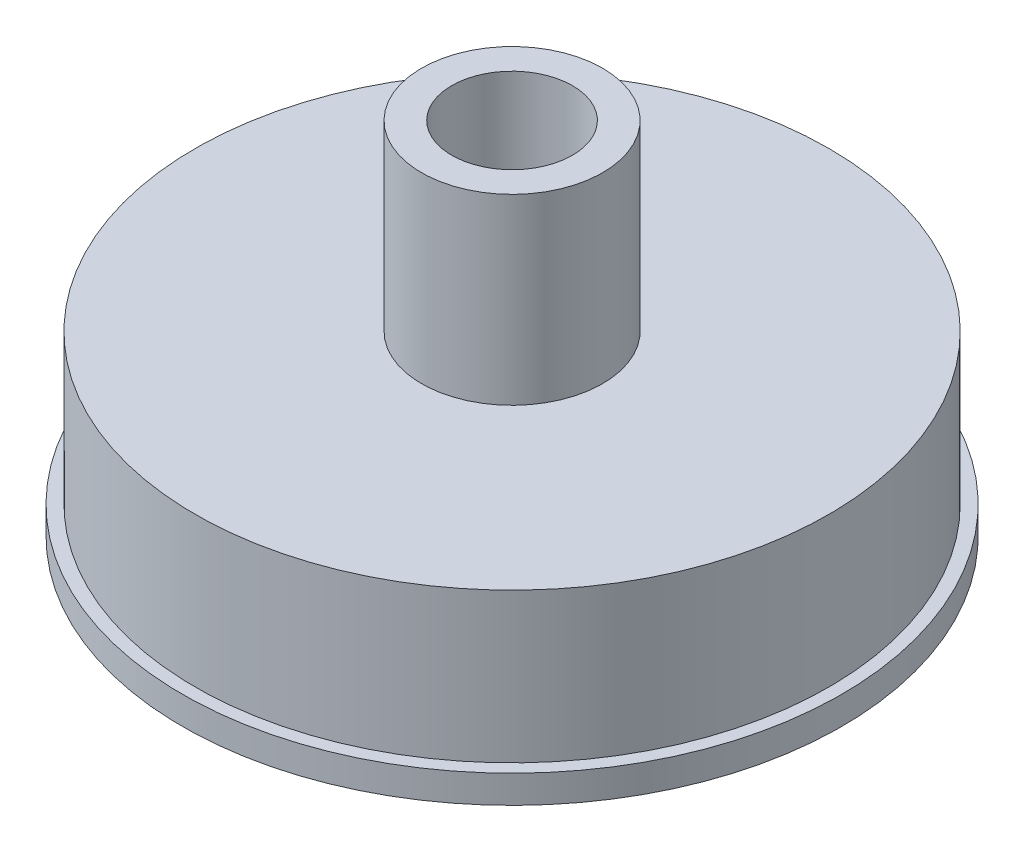
ISO-10303-21;
HEADER;
FILE_DESCRIPTION(('STEP AP214'),'2;1');
FILE_NAME('part.step','',(''),(''),'','','');
FILE_SCHEMA(('AUTOMOTIVE_DESIGN { 1 0 10303 214 1 1 1 1 }'));
ENDSEC;
DATA;
#1=APPLICATION_CONTEXT('core data for automotive mechanical design processes');
#2=APPLICATION_PROTOCOL_DEFINITION('international standard','automotive_design',2000,#1);
#3=PRODUCT_CONTEXT('',#1,'mechanical');
#4=PRODUCT('Part','Part','',(#3));
#5=PRODUCT_RELATED_PRODUCT_CATEGORY('part','',(#4));
#6=PRODUCT_DEFINITION_FORMATION('','',#4);
#7=PRODUCT_DEFINITION_CONTEXT('part definition',#1,'design');
#8=PRODUCT_DEFINITION('design','',#6,#7);
#9=PRODUCT_DEFINITION_SHAPE('','',#8);
#10=(LENGTH_UNIT() NAMED_UNIT(*) SI_UNIT(.MILLI.,.METRE.));
#11=(NAMED_UNIT(*) PLANE_ANGLE_UNIT() SI_UNIT($,.RADIAN.));
#12=(NAMED_UNIT(*) SI_UNIT($,.STERADIAN.) SOLID_ANGLE_UNIT());
#13=UNCERTAINTY_MEASURE_WITH_UNIT(LENGTH_MEASURE(1.E-05),#10,'distance_accuracy_value','');
#14=(GEOMETRIC_REPRESENTATION_CONTEXT(3) GLOBAL_UNCERTAINTY_ASSIGNED_CONTEXT((#13)) GLOBAL_UNIT_ASSIGNED_CONTEXT((#10,
#11,#12)) REPRESENTATION_CONTEXT('',''));
#15=CARTESIAN_POINT('',(0.,0.,0.));
#16=DIRECTION('',(0.,0.,1.));
#17=DIRECTION('',(1.,0.,0.));
#18=AXIS2_PLACEMENT_3D('',#15,#16,#17);
#19=CARTESIAN_POINT('',(0.,0.,0.));
#20=DIRECTION('',(0.,-1.,0.));
#21=DIRECTION('',(0.,0.,-1.));
#22=AXIS2_PLACEMENT_3D('',#19,#20,#21);
#23=CYLINDRICAL_SURFACE('',#22,21.);
#24=CARTESIAN_POINT('',(0.,0.,0.));
#25=DIRECTION('',(0.,-1.,0.));
#26=DIRECTION('',(0.,0.,-1.));
#27=AXIS2_PLACEMENT_3D('',#24,#25,#26);
#28=CIRCLE('',#27,21.);
#29=CARTESIAN_POINT('',(0.,0.,-21.));
#30=VERTEX_POINT('',#29);
#31=EDGE_CURVE('E10',#30,#30,#28,.T.);
#32=ORIENTED_EDGE('',*,*,#31,.T.);
#33=EDGE_LOOP('',(#32));
#34=FACE_BOUND('',#33,.T.);
#35=CARTESIAN_POINT('',(0.,11.,0.));
#36=DIRECTION('',(0.,-1.,0.));
#37=DIRECTION('',(0.,0.,-1.));
#38=AXIS2_PLACEMENT_3D('',#35,#36,#37);
#39=CIRCLE('',#38,21.);
#40=CARTESIAN_POINT('',(0.,11.,-21.));
#41=VERTEX_POINT('',#40);
#42=EDGE_CURVE('E67',#41,#41,#39,.T.);
#43=ORIENTED_EDGE('',*,*,#42,.F.);
#44=EDGE_LOOP('',(#43));
#45=FACE_BOUND('',#44,.T.);
#46=ADVANCED_FACE('F33',(#34,#45),#23,.F.);
#47=CARTESIAN_POINT('',(21.,0.,0.));
#48=DIRECTION('',(0.,-1.,0.));
#49=DIRECTION('',(0.,0.,-1.));
#50=AXIS2_PLACEMENT_3D('',#47,#48,#49);
#51=PLANE('',#50);
#52=CARTESIAN_POINT('',(0.,0.,0.));
#53=DIRECTION('',(0.,-1.,0.));
#54=DIRECTION('',(0.,0.,-1.));
#55=AXIS2_PLACEMENT_3D('',#52,#53,#54);
#56=CIRCLE('',#55,26.);
#57=CARTESIAN_POINT('',(0.,0.,-26.));
#58=VERTEX_POINT('',#57);
#59=EDGE_CURVE('E39',#58,#58,#56,.T.);
#60=ORIENTED_EDGE('',*,*,#59,.T.);
#61=EDGE_LOOP('',(#60));
#62=FACE_BOUND('',#61,.T.);
#63=ORIENTED_EDGE('',*,*,#31,.F.);
#64=EDGE_LOOP('',(#63));
#65=FACE_BOUND('',#64,.T.);
#66=ADVANCED_FACE('F75',(#62,#65),#51,.T.);
#67=CARTESIAN_POINT('',(0.,0.,0.));
#68=DIRECTION('',(0.,-1.,0.));
#69=DIRECTION('',(0.,0.,-1.));
#70=AXIS2_PLACEMENT_3D('',#67,#68,#69);
#71=CYLINDRICAL_SURFACE('',#70,26.);
#72=CARTESIAN_POINT('',(0.,2.2,0.));
#73=DIRECTION('',(0.,-1.,0.));
#74=DIRECTION('',(0.,0.,-1.));
#75=AXIS2_PLACEMENT_3D('',#72,#73,#74);
#76=CIRCLE('',#75,26.);
#77=CARTESIAN_POINT('',(0.,2.2,-26.));
#78=VERTEX_POINT('',#77);
#79=EDGE_CURVE('E43',#78,#78,#76,.T.);
#80=ORIENTED_EDGE('',*,*,#79,.T.);
#81=EDGE_LOOP('',(#80));
#82=FACE_BOUND('',#81,.T.);
#83=ORIENTED_EDGE('',*,*,#59,.F.);
#84=EDGE_LOOP('',(#83));
#85=FACE_BOUND('',#84,.T.);
#86=ADVANCED_FACE('F79',(#82,#85),#71,.T.);
#87=CARTESIAN_POINT('',(26.,2.2,0.));
#88=DIRECTION('',(0.,1.,0.));
#89=DIRECTION('',(0.,0.,1.));
#90=AXIS2_PLACEMENT_3D('',#87,#88,#89);
#91=PLANE('',#90);
#92=CARTESIAN_POINT('',(0.,2.2,0.));
#93=DIRECTION('',(0.,-1.,0.));
#94=DIRECTION('',(0.,0.,-1.));
#95=AXIS2_PLACEMENT_3D('',#92,#93,#94);
#96=CIRCLE('',#95,25.);
#97=CARTESIAN_POINT('',(0.,2.2,-25.));
#98=VERTEX_POINT('',#97);
#99=EDGE_CURVE('E47',#98,#98,#96,.T.);
#100=ORIENTED_EDGE('',*,*,#99,.T.);
#101=EDGE_LOOP('',(#100));
#102=FACE_BOUND('',#101,.T.);
#103=ORIENTED_EDGE('',*,*,#79,.F.);
#104=EDGE_LOOP('',(#103));
#105=FACE_BOUND('',#104,.T.);
#106=ADVANCED_FACE('F83',(#102,#105),#91,.T.);
#107=CARTESIAN_POINT('',(0.,0.,0.));
#108=DIRECTION('',(0.,-1.,0.));
#109=DIRECTION('',(0.,0.,-1.));
#110=AXIS2_PLACEMENT_3D('',#107,#108,#109);
#111=CYLINDRICAL_SURFACE('',#110,25.);
#112=CARTESIAN_POINT('',(0.,14.,0.));
#113=DIRECTION('',(0.,-1.,0.));
#114=DIRECTION('',(0.,0.,-1.));
#115=AXIS2_PLACEMENT_3D('',#112,#113,#114);
#116=CIRCLE('',#115,25.);
#117=CARTESIAN_POINT('',(0.,14.,-25.));
#118=VERTEX_POINT('',#117);
#119=EDGE_CURVE('E52',#118,#118,#116,.T.);
#120=ORIENTED_EDGE('',*,*,#119,.T.);
#121=EDGE_LOOP('',(#120));
#122=FACE_BOUND('',#121,.T.);
#123=ORIENTED_EDGE('',*,*,#99,.F.);
#124=EDGE_LOOP('',(#123));
#125=FACE_BOUND('',#124,.T.);
#126=ADVANCED_FACE('F90',(#122,#125),#111,.T.);
#127=CARTESIAN_POINT('',(25.,14.,0.));
#128=DIRECTION('',(0.,1.,0.));
#129=DIRECTION('',(0.,0.,1.));
#130=AXIS2_PLACEMENT_3D('',#127,#128,#129);
#131=PLANE('',#130);
#132=CARTESIAN_POINT('',(0.,14.,0.));
#133=DIRECTION('',(0.,-1.,0.));
#134=DIRECTION('',(0.,0.,-1.));
#135=AXIS2_PLACEMENT_3D('',#132,#133,#134);
#136=CIRCLE('',#135,7.14375);
#137=CARTESIAN_POINT('',(0.,14.,-7.14375));
#138=VERTEX_POINT('',#137);
#139=EDGE_CURVE('E55',#138,#138,#136,.T.);
#140=ORIENTED_EDGE('',*,*,#139,.T.);
#141=EDGE_LOOP('',(#140));
#142=FACE_BOUND('',#141,.T.);
#143=ORIENTED_EDGE('',*,*,#119,.F.);
#144=EDGE_LOOP('',(#143));
#145=FACE_BOUND('',#144,.T.);
#146=ADVANCED_FACE('F94',(#142,#145),#131,.T.);
#147=CARTESIAN_POINT('',(0.,0.,0.));
#148=DIRECTION('',(0.,-1.,0.));
#149=DIRECTION('',(0.,0.,-1.));
#150=AXIS2_PLACEMENT_3D('',#147,#148,#149);
#151=CYLINDRICAL_SURFACE('',#150,7.14375);
#152=CARTESIAN_POINT('',(0.,28.4125,0.));
#153=DIRECTION('',(0.,-1.,0.));
#154=DIRECTION('',(0.,0.,-1.));
#155=AXIS2_PLACEMENT_3D('',#152,#153,#154);
#156=CIRCLE('',#155,7.14375);
#157=CARTESIAN_POINT('',(0.,28.4125,-7.14375));
#158=VERTEX_POINT('',#157);
#159=EDGE_CURVE('E58',#158,#158,#156,.T.);
#160=ORIENTED_EDGE('',*,*,#159,.T.);
#161=EDGE_LOOP('',(#160));
#162=FACE_BOUND('',#161,.T.);
#163=ORIENTED_EDGE('',*,*,#139,.F.);
#164=EDGE_LOOP('',(#163));
#165=FACE_BOUND('',#164,.T.);
#166=ADVANCED_FACE('F98',(#162,#165),#151,.T.);
#167=CARTESIAN_POINT('',(7.14375,28.4125,0.));
#168=DIRECTION('',(0.,1.,0.));
#169=DIRECTION('',(0.,0.,1.));
#170=AXIS2_PLACEMENT_3D('',#167,#168,#169);
#171=PLANE('',#170);
#172=CARTESIAN_POINT('',(0.,28.4125,0.));
#173=DIRECTION('',(0.,-1.,0.));
#174=DIRECTION('',(0.,0.,-1.));
#175=AXIS2_PLACEMENT_3D('',#172,#173,#174);
#176=CIRCLE('',#175,4.7625);
#177=CARTESIAN_POINT('',(0.,28.4125,-4.7625));
#178=VERTEX_POINT('',#177);
#179=EDGE_CURVE('E61',#178,#178,#176,.T.);
#180=ORIENTED_EDGE('',*,*,#179,.T.);
#181=EDGE_LOOP('',(#180));
#182=FACE_BOUND('',#181,.T.);
#183=ORIENTED_EDGE('',*,*,#159,.F.);
#184=EDGE_LOOP('',(#183));
#185=FACE_BOUND('',#184,.T.);
#186=ADVANCED_FACE('F102',(#182,#185),#171,.T.);
#187=CARTESIAN_POINT('',(0.,0.,0.));
#188=DIRECTION('',(0.,-1.,0.));
#189=DIRECTION('',(0.,0.,-1.));
#190=AXIS2_PLACEMENT_3D('',#187,#188,#189);
#191=CYLINDRICAL_SURFACE('',#190,4.7625);
#192=CARTESIAN_POINT('',(0.,11.,0.));
#193=DIRECTION('',(0.,-1.,0.));
#194=DIRECTION('',(0.,0.,-1.));
#195=AXIS2_PLACEMENT_3D('',#192,#193,#194);
#196=CIRCLE('',#195,4.7625);
#197=CARTESIAN_POINT('',(0.,11.,-4.7625));
#198=VERTEX_POINT('',#197);
#199=EDGE_CURVE('E64',#198,#198,#196,.T.);
#200=ORIENTED_EDGE('',*,*,#199,.T.);
#201=EDGE_LOOP('',(#200));
#202=FACE_BOUND('',#201,.T.);
#203=ORIENTED_EDGE('',*,*,#179,.F.);
#204=EDGE_LOOP('',(#203));
#205=FACE_BOUND('',#204,.T.);
#206=ADVANCED_FACE('F106',(#202,#205),#191,.F.);
#207=CARTESIAN_POINT('',(21.,11.,0.));
#208=DIRECTION('',(0.,-1.,0.));
#209=DIRECTION('',(0.,0.,-1.));
#210=AXIS2_PLACEMENT_3D('',#207,#208,#209);
#211=PLANE('',#210);
#212=ORIENTED_EDGE('',*,*,#42,.T.);
#213=EDGE_LOOP('',(#212));
#214=FACE_BOUND('',#213,.T.);
#215=ORIENTED_EDGE('',*,*,#199,.F.);
#216=EDGE_LOOP('',(#215));
#217=FACE_BOUND('',#216,.T.);
#218=ADVANCED_FACE('F71',(#214,#217),#211,.T.);
#219=CLOSED_SHELL('',(#46,#66,#86,#106,#126,#146,#166,#186,#206,#218));
#220=MANIFOLD_SOLID_BREP('B2',#219);
#221=ADVANCED_BREP_SHAPE_REPRESENTATION('',(#18,#220),#14);
#222=SHAPE_DEFINITION_REPRESENTATION(#9,#221);
ENDSEC;
END-ISO-10303-21;
